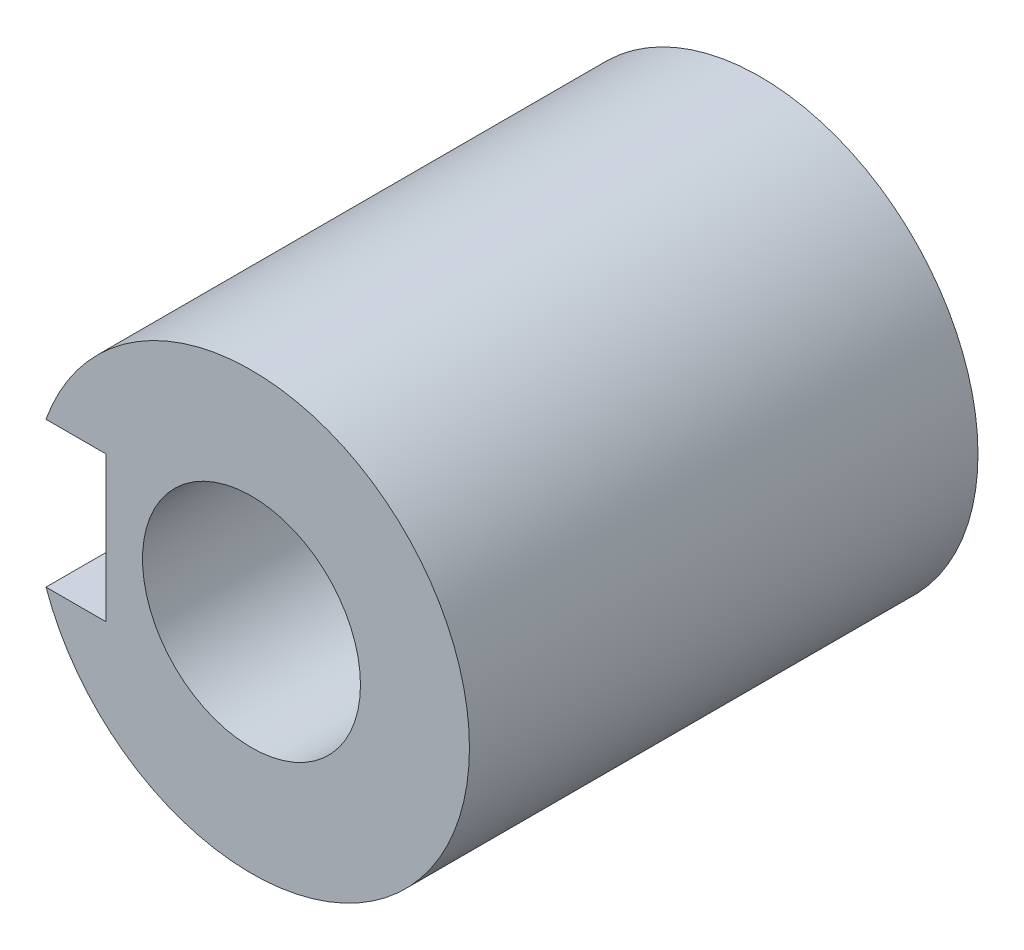
ISO-10303-21;
HEADER;
FILE_DESCRIPTION(('STEP AP214'),'2;1');
FILE_NAME('part.step','',(''),(''),'','','');
FILE_SCHEMA(('AUTOMOTIVE_DESIGN { 1 0 10303 214 1 1 1 1 }'));
ENDSEC;
DATA;
#1=APPLICATION_CONTEXT('core data for automotive mechanical design processes');
#2=APPLICATION_PROTOCOL_DEFINITION('international standard','automotive_design',2000,#1);
#3=PRODUCT_CONTEXT('',#1,'mechanical');
#4=PRODUCT('Part','Part','',(#3));
#5=PRODUCT_RELATED_PRODUCT_CATEGORY('part','',(#4));
#6=PRODUCT_DEFINITION_FORMATION('','',#4);
#7=PRODUCT_DEFINITION_CONTEXT('part definition',#1,'design');
#8=PRODUCT_DEFINITION('design','',#6,#7);
#9=PRODUCT_DEFINITION_SHAPE('','',#8);
#10=(LENGTH_UNIT() NAMED_UNIT(*) SI_UNIT(.MILLI.,.METRE.));
#11=(NAMED_UNIT(*) PLANE_ANGLE_UNIT() SI_UNIT($,.RADIAN.));
#12=(NAMED_UNIT(*) SI_UNIT($,.STERADIAN.) SOLID_ANGLE_UNIT());
#13=UNCERTAINTY_MEASURE_WITH_UNIT(LENGTH_MEASURE(1.E-05),#10,'distance_accuracy_value','');
#14=(GEOMETRIC_REPRESENTATION_CONTEXT(3) GLOBAL_UNCERTAINTY_ASSIGNED_CONTEXT((#13)) GLOBAL_UNIT_ASSIGNED_CONTEXT((#10,
#11,#12)) REPRESENTATION_CONTEXT('',''));
#15=CARTESIAN_POINT('',(0.,0.,0.));
#16=DIRECTION('',(0.,0.,1.));
#17=DIRECTION('',(1.,0.,0.));
#18=AXIS2_PLACEMENT_3D('',#15,#16,#17);
#19=CARTESIAN_POINT('',(3.3166247903554,2.,9.));
#20=DIRECTION('',(0.,0.,-1.));
#21=DIRECTION('',(-1.,0.,0.));
#22=AXIS2_PLACEMENT_3D('',#19,#20,#21);
#23=PLANE('',#22);
#24=CARTESIAN_POINT('',(3.3166247903554,-2.,9.));
#25=DIRECTION('',(0.,0.,-1.));
#26=DIRECTION('',(-1.,0.,0.));
#27=AXIS2_PLACEMENT_3D('',#24,#25,#26);
#28=CIRCLE('',#27,3.);
#29=CARTESIAN_POINT('',(6.,-0.65854650312998,9.));
#30=VERTEX_POINT('',#29);
#31=CARTESIAN_POINT('',(3.3166247903554,-5.,9.));
#32=VERTEX_POINT('',#31);
#33=EDGE_CURVE('E138',#30,#32,#28,.T.);
#34=ORIENTED_EDGE('',*,*,#33,.T.);
#35=CARTESIAN_POINT('',(0.,0.,9.));
#36=DIRECTION('',(0.,0.,-1.));
#37=DIRECTION('',(-1.,0.,0.));
#38=AXIS2_PLACEMENT_3D('',#35,#36,#37);
#39=CIRCLE('',#38,6.);
#40=CARTESIAN_POINT('',(6.,0.,9.));
#41=VERTEX_POINT('',#40);
#42=EDGE_CURVE('E142',#32,#41,#39,.F.);
#43=ORIENTED_EDGE('',*,*,#42,.T.);
#44=DIRECTION('',(0.,-1.,0.));
#45=VECTOR('',#44,1.);
#46=CARTESIAN_POINT('',(6.,0.658546503129978,9.));
#47=LINE('',#46,#45);
#48=EDGE_CURVE('E302',#41,#30,#47,.T.);
#49=ORIENTED_EDGE('',*,*,#48,.T.);
#50=EDGE_LOOP('',(#34,#43,#49));
#51=FACE_BOUND('',#50,.T.);
#52=ADVANCED_FACE('F35',(#51),#23,.T.);
#53=CARTESIAN_POINT('',(6.,0.658546503129978,9.));
#54=VERTEX_POINT('',#53);
#55=EDGE_CURVE('E303',#54,#41,#47,.T.);
#56=ORIENTED_EDGE('',*,*,#55,.T.);
#57=CARTESIAN_POINT('',(3.3166247903554,5.,9.));
#58=VERTEX_POINT('',#57);
#59=EDGE_CURVE('E325',#41,#58,#39,.F.);
#60=ORIENTED_EDGE('',*,*,#59,.T.);
#61=CARTESIAN_POINT('',(3.3166247903554,2.,9.));
#62=DIRECTION('',(0.,0.,-1.));
#63=DIRECTION('',(-1.,0.,0.));
#64=AXIS2_PLACEMENT_3D('',#61,#62,#63);
#65=CIRCLE('',#64,3.);
#66=EDGE_CURVE('E194',#58,#54,#65,.T.);
#67=ORIENTED_EDGE('',*,*,#66,.T.);
#68=EDGE_LOOP('',(#56,#60,#67));
#69=FACE_BOUND('',#68,.T.);
#70=ADVANCED_FACE('F262',(#69),#23,.T.);
#71=DIRECTION('',(0.,1.,0.));
#72=VECTOR('',#71,1.);
#73=CARTESIAN_POINT('',(-6.,0.65854650312998,9.));
#74=LINE('',#73,#72);
#75=CARTESIAN_POINT('',(-6.,-0.658546503129985,9.));
#76=VERTEX_POINT('',#75);
#77=CARTESIAN_POINT('',(-6.,0.,9.));
#78=VERTEX_POINT('',#77);
#79=EDGE_CURVE('E150',#76,#78,#74,.T.);
#80=ORIENTED_EDGE('',*,*,#79,.T.);
#81=CARTESIAN_POINT('',(-3.3166247903554,-5.,9.));
#82=VERTEX_POINT('',#81);
#83=EDGE_CURVE('E50',#78,#82,#39,.F.);
#84=ORIENTED_EDGE('',*,*,#83,.T.);
#85=CARTESIAN_POINT('',(-3.3166247903554,-2.,9.));
#86=DIRECTION('',(0.,0.,-1.));
#87=DIRECTION('',(-1.,0.,0.));
#88=AXIS2_PLACEMENT_3D('',#85,#86,#87);
#89=CIRCLE('',#88,3.);
#90=EDGE_CURVE('E137',#82,#76,#89,.T.);
#91=ORIENTED_EDGE('',*,*,#90,.T.);
#92=EDGE_LOOP('',(#80,#84,#91));
#93=FACE_BOUND('',#92,.T.);
#94=ADVANCED_FACE('F147',(#93),#23,.T.);
#95=CARTESIAN_POINT('',(0.,6.,27.));
#96=DIRECTION('',(0.,0.,1.));
#97=DIRECTION('',(1.,0.,0.));
#98=AXIS2_PLACEMENT_3D('',#95,#96,#97);
#99=PLANE('',#98);
#100=CARTESIAN_POINT('',(0.,0.,27.));
#101=DIRECTION('',(0.,0.,1.));
#102=DIRECTION('',(1.,0.,0.));
#103=AXIS2_PLACEMENT_3D('',#100,#101,#102);
#104=CIRCLE('',#103,6.);
#105=CARTESIAN_POINT('',(6.,0.,27.));
#106=VERTEX_POINT('',#105);
#107=EDGE_CURVE('E295',#106,#106,#104,.T.);
#108=ORIENTED_EDGE('',*,*,#107,.F.);
#109=EDGE_LOOP('',(#108));
#110=FACE_BOUND('',#109,.T.);
#111=CARTESIAN_POINT('',(0.,0.,27.));
#112=DIRECTION('',(0.,0.,1.));
#113=DIRECTION('',(1.,0.,0.));
#114=AXIS2_PLACEMENT_3D('',#111,#112,#113);
#115=CIRCLE('',#114,12.);
#116=CARTESIAN_POINT('',(-11.3137084989848,4.,27.));
#117=VERTEX_POINT('',#116);
#118=CARTESIAN_POINT('',(-11.3137084989848,-4.,27.));
#119=VERTEX_POINT('',#118);
#120=EDGE_CURVE('E43',#117,#119,#115,.F.);
#121=ORIENTED_EDGE('',*,*,#120,.F.);
#122=DIRECTION('',(-1.,0.,0.));
#123=VECTOR('',#122,1.);
#124=CARTESIAN_POINT('',(-11.3137084989848,4.,27.));
#125=LINE('',#124,#123);
#126=CARTESIAN_POINT('',(-8.,4.,27.));
#127=VERTEX_POINT('',#126);
#128=EDGE_CURVE('E225',#127,#117,#125,.T.);
#129=ORIENTED_EDGE('',*,*,#128,.F.);
#130=DIRECTION('',(0.,1.,0.));
#131=VECTOR('',#130,1.);
#132=CARTESIAN_POINT('',(-8.,4.,27.));
#133=LINE('',#132,#131);
#134=CARTESIAN_POINT('',(-8.,-4.,27.));
#135=VERTEX_POINT('',#134);
#136=EDGE_CURVE('E229',#135,#127,#133,.T.);
#137=ORIENTED_EDGE('',*,*,#136,.F.);
#138=DIRECTION('',(1.,0.,0.));
#139=VECTOR('',#138,1.);
#140=CARTESIAN_POINT('',(-11.3137084989848,-4.,27.));
#141=LINE('',#140,#139);
#142=EDGE_CURVE('E210',#119,#135,#141,.T.);
#143=ORIENTED_EDGE('',*,*,#142,.F.);
#144=EDGE_LOOP('',(#121,#129,#137,#143));
#145=FACE_BOUND('',#144,.T.);
#146=ADVANCED_FACE('F37',(#110,#145),#99,.T.);
#147=CARTESIAN_POINT('',(0.,0.,-1.));
#148=DIRECTION('',(0.,0.,-1.));
#149=DIRECTION('',(-1.,0.,0.));
#150=AXIS2_PLACEMENT_3D('',#147,#148,#149);
#151=PLANE('',#150);
#152=CARTESIAN_POINT('',(3.3166247903554,2.,-1.));
#153=DIRECTION('',(0.,0.,-1.));
#154=DIRECTION('',(-1.,0.,0.));
#155=AXIS2_PLACEMENT_3D('',#152,#153,#154);
#156=CIRCLE('',#155,3.);
#157=CARTESIAN_POINT('',(3.3166247903554,5.,-1.));
#158=VERTEX_POINT('',#157);
#159=CARTESIAN_POINT('',(6.,0.658546503129978,-1.));
#160=VERTEX_POINT('',#159);
#161=EDGE_CURVE('E58',#158,#160,#156,.T.);
#162=ORIENTED_EDGE('',*,*,#161,.F.);
#163=DIRECTION('',(1.,0.,0.));
#164=VECTOR('',#163,1.);
#165=CARTESIAN_POINT('',(3.3166247903554,5.,-1.));
#166=LINE('',#165,#164);
#167=CARTESIAN_POINT('',(-3.3166247903554,5.,-1.));
#168=VERTEX_POINT('',#167);
#169=EDGE_CURVE('E191',#168,#158,#166,.T.);
#170=ORIENTED_EDGE('',*,*,#169,.F.);
#171=CARTESIAN_POINT('',(-3.3166247903554,2.,-1.));
#172=DIRECTION('',(0.,0.,-1.));
#173=DIRECTION('',(-1.,0.,0.));
#174=AXIS2_PLACEMENT_3D('',#171,#172,#173);
#175=CIRCLE('',#174,3.);
#176=CARTESIAN_POINT('',(-6.,0.65854650312998,-1.));
#177=VERTEX_POINT('',#176);
#178=EDGE_CURVE('E188',#177,#168,#175,.T.);
#179=ORIENTED_EDGE('',*,*,#178,.F.);
#180=DIRECTION('',(0.,1.,0.));
#181=VECTOR('',#180,1.);
#182=CARTESIAN_POINT('',(-6.,0.65854650312998,-1.));
#183=LINE('',#182,#181);
#184=CARTESIAN_POINT('',(-6.,-0.658546503129985,-1.));
#185=VERTEX_POINT('',#184);
#186=EDGE_CURVE('E185',#185,#177,#183,.T.);
#187=ORIENTED_EDGE('',*,*,#186,.F.);
#188=CARTESIAN_POINT('',(-3.3166247903554,-2.,-1.));
#189=DIRECTION('',(0.,0.,-1.));
#190=DIRECTION('',(-1.,0.,0.));
#191=AXIS2_PLACEMENT_3D('',#188,#189,#190);
#192=CIRCLE('',#191,3.);
#193=CARTESIAN_POINT('',(-3.3166247903554,-5.,-1.));
#194=VERTEX_POINT('',#193);
#195=EDGE_CURVE('E183',#194,#185,#192,.T.);
#196=ORIENTED_EDGE('',*,*,#195,.F.);
#197=DIRECTION('',(-1.,0.,0.));
#198=VECTOR('',#197,1.);
#199=CARTESIAN_POINT('',(3.3166247903554,-5.,-1.));
#200=LINE('',#199,#198);
#201=CARTESIAN_POINT('',(3.3166247903554,-5.,-1.));
#202=VERTEX_POINT('',#201);
#203=EDGE_CURVE('E156',#202,#194,#200,.T.);
#204=ORIENTED_EDGE('',*,*,#203,.F.);
#205=CARTESIAN_POINT('',(3.3166247903554,-2.,-1.));
#206=DIRECTION('',(0.,0.,-1.));
#207=DIRECTION('',(-1.,0.,0.));
#208=AXIS2_PLACEMENT_3D('',#205,#206,#207);
#209=CIRCLE('',#208,3.);
#210=CARTESIAN_POINT('',(6.,-0.65854650312998,-1.));
#211=VERTEX_POINT('',#210);
#212=EDGE_CURVE('E179',#211,#202,#209,.T.);
#213=ORIENTED_EDGE('',*,*,#212,.F.);
#214=DIRECTION('',(0.,-1.,0.));
#215=VECTOR('',#214,1.);
#216=CARTESIAN_POINT('',(6.,0.658546503129978,-1.));
#217=LINE('',#216,#215);
#218=EDGE_CURVE('E176',#160,#211,#217,.T.);
#219=ORIENTED_EDGE('',*,*,#218,.F.);
#220=EDGE_LOOP('',(#162,#170,#179,#187,#196,#204,#213,#219));
#221=FACE_BOUND('',#220,.T.);
#222=CARTESIAN_POINT('',(0.,0.,-1.));
#223=DIRECTION('',(0.,0.,-1.));
#224=DIRECTION('',(-1.,0.,0.));
#225=AXIS2_PLACEMENT_3D('',#222,#223,#224);
#226=CIRCLE('',#225,12.);
#227=CARTESIAN_POINT('',(-11.3137084989848,4.,-1.));
#228=VERTEX_POINT('',#227);
#229=CARTESIAN_POINT('',(-11.3137084989848,-4.,-1.));
#230=VERTEX_POINT('',#229);
#231=EDGE_CURVE('E197',#228,#230,#226,.T.);
#232=ORIENTED_EDGE('',*,*,#231,.T.);
#233=DIRECTION('',(1.,0.,0.));
#234=VECTOR('',#233,1.);
#235=CARTESIAN_POINT('',(-11.3137084989848,-4.,-1.));
#236=LINE('',#235,#234);
#237=CARTESIAN_POINT('',(-8.,-4.,-1.));
#238=VERTEX_POINT('',#237);
#239=EDGE_CURVE('E214',#230,#238,#236,.T.);
#240=ORIENTED_EDGE('',*,*,#239,.T.);
#241=DIRECTION('',(0.,1.,0.));
#242=VECTOR('',#241,1.);
#243=CARTESIAN_POINT('',(-8.,4.,-1.));
#244=LINE('',#243,#242);
#245=CARTESIAN_POINT('',(-8.,4.,-1.));
#246=VERTEX_POINT('',#245);
#247=EDGE_CURVE('E211',#238,#246,#244,.T.);
#248=ORIENTED_EDGE('',*,*,#247,.T.);
#249=DIRECTION('',(-1.,0.,0.));
#250=VECTOR('',#249,1.);
#251=CARTESIAN_POINT('',(-11.3137084989848,4.,-1.));
#252=LINE('',#251,#250);
#253=EDGE_CURVE('E207',#246,#228,#252,.T.);
#254=ORIENTED_EDGE('',*,*,#253,.T.);
#255=EDGE_LOOP('',(#232,#240,#248,#254));
#256=FACE_BOUND('',#255,.T.);
#257=ADVANCED_FACE('F244',(#221,#256),#151,.T.);
#258=CARTESIAN_POINT('',(-11.3137084989848,-4.,60.459363472362));
#259=DIRECTION('',(0.,1.,0.));
#260=DIRECTION('',(-1.,0.,0.));
#261=AXIS2_PLACEMENT_3D('',#258,#259,#260);
#262=PLANE('',#261);
#263=DIRECTION('',(0.,0.,-1.));
#264=VECTOR('',#263,1.);
#265=CARTESIAN_POINT('',(-11.3137084989848,-4.,60.459363472362));
#266=LINE('',#265,#264);
#267=EDGE_CURVE('E11',#119,#230,#266,.T.);
#268=ORIENTED_EDGE('',*,*,#267,.F.);
#269=ORIENTED_EDGE('',*,*,#142,.T.);
#270=DIRECTION('',(0.,0.,-1.));
#271=VECTOR('',#270,1.);
#272=CARTESIAN_POINT('',(-8.,-4.,60.459363472362));
#273=LINE('',#272,#271);
#274=EDGE_CURVE('E221',#135,#238,#273,.T.);
#275=ORIENTED_EDGE('',*,*,#274,.T.);
#276=ORIENTED_EDGE('',*,*,#239,.F.);
#277=EDGE_LOOP('',(#268,#269,#275,#276));
#278=FACE_BOUND('',#277,.T.);
#279=ADVANCED_FACE('F238',(#278),#262,.T.);
#280=CARTESIAN_POINT('',(-8.,4.,60.459363472362));
#281=DIRECTION('',(-1.,0.,0.));
#282=DIRECTION('',(0.,-1.,0.));
#283=AXIS2_PLACEMENT_3D('',#280,#281,#282);
#284=PLANE('',#283);
#285=ORIENTED_EDGE('',*,*,#274,.F.);
#286=ORIENTED_EDGE('',*,*,#136,.T.);
#287=DIRECTION('',(0.,0.,-1.));
#288=VECTOR('',#287,1.);
#289=CARTESIAN_POINT('',(-8.,4.,60.459363472362));
#290=LINE('',#289,#288);
#291=EDGE_CURVE('E228',#127,#246,#290,.T.);
#292=ORIENTED_EDGE('',*,*,#291,.T.);
#293=ORIENTED_EDGE('',*,*,#247,.F.);
#294=EDGE_LOOP('',(#285,#286,#292,#293));
#295=FACE_BOUND('',#294,.T.);
#296=ADVANCED_FACE('F240',(#295),#284,.T.);
#297=CARTESIAN_POINT('',(-11.3137084989848,4.,60.459363472362));
#298=DIRECTION('',(0.,-1.,0.));
#299=DIRECTION('',(0.,0.,-1.));
#300=AXIS2_PLACEMENT_3D('',#297,#298,#299);
#301=PLANE('',#300);
#302=ORIENTED_EDGE('',*,*,#291,.F.);
#303=ORIENTED_EDGE('',*,*,#128,.T.);
#304=DIRECTION('',(0.,0.,-1.));
#305=VECTOR('',#304,1.);
#306=CARTESIAN_POINT('',(-11.3137084989848,4.,60.459363472362));
#307=LINE('',#306,#305);
#308=EDGE_CURVE('E224',#117,#228,#307,.T.);
#309=ORIENTED_EDGE('',*,*,#308,.T.);
#310=ORIENTED_EDGE('',*,*,#253,.F.);
#311=EDGE_LOOP('',(#302,#303,#309,#310));
#312=FACE_BOUND('',#311,.T.);
#313=ADVANCED_FACE('F251',(#312),#301,.T.);
#314=CARTESIAN_POINT('',(0.,0.,60.459363472362));
#315=DIRECTION('',(0.,0.,-1.));
#316=DIRECTION('',(-1.,0.,0.));
#317=AXIS2_PLACEMENT_3D('',#314,#315,#316);
#318=CYLINDRICAL_SURFACE('',#317,12.);
#319=ORIENTED_EDGE('',*,*,#308,.F.);
#320=ORIENTED_EDGE('',*,*,#120,.T.);
#321=ORIENTED_EDGE('',*,*,#267,.T.);
#322=ORIENTED_EDGE('',*,*,#231,.F.);
#323=EDGE_LOOP('',(#319,#320,#321,#322));
#324=FACE_BOUND('',#323,.T.);
#325=ADVANCED_FACE('F248',(#324),#318,.T.);
#326=CARTESIAN_POINT('',(3.3166247903554,2.,9.));
#327=DIRECTION('',(0.,0.,-1.));
#328=DIRECTION('',(-1.,0.,0.));
#329=AXIS2_PLACEMENT_3D('',#326,#327,#328);
#330=CYLINDRICAL_SURFACE('',#329,3.);
#331=ORIENTED_EDGE('',*,*,#161,.T.);
#332=DIRECTION('',(0.,0.,-1.));
#333=VECTOR('',#332,1.);
#334=CARTESIAN_POINT('',(6.,0.658546503129978,9.));
#335=LINE('',#334,#333);
#336=EDGE_CURVE('E174',#54,#160,#335,.T.);
#337=ORIENTED_EDGE('',*,*,#336,.F.);
#338=ORIENTED_EDGE('',*,*,#66,.F.);
#339=DIRECTION('',(0.,0.,-1.));
#340=VECTOR('',#339,1.);
#341=CARTESIAN_POINT('',(3.3166247903554,5.,9.));
#342=LINE('',#341,#340);
#343=EDGE_CURVE('E195',#58,#158,#342,.T.);
#344=ORIENTED_EDGE('',*,*,#343,.T.);
#345=EDGE_LOOP('',(#331,#337,#338,#344));
#346=FACE_BOUND('',#345,.T.);
#347=ADVANCED_FACE('F258',(#346),#330,.F.);
#348=CARTESIAN_POINT('',(3.3166247903554,5.,9.));
#349=DIRECTION('',(0.,1.,0.));
#350=DIRECTION('',(0.,0.,1.));
#351=AXIS2_PLACEMENT_3D('',#348,#349,#350);
#352=PLANE('',#351);
#353=ORIENTED_EDGE('',*,*,#169,.T.);
#354=ORIENTED_EDGE('',*,*,#343,.F.);
#355=DIRECTION('',(1.,0.,0.));
#356=VECTOR('',#355,1.);
#357=CARTESIAN_POINT('',(3.3166247903554,5.,9.));
#358=LINE('',#357,#356);
#359=CARTESIAN_POINT('',(-3.31662479035541,5.,9.));
#360=VERTEX_POINT('',#359);
#361=EDGE_CURVE('E172',#360,#58,#358,.T.);
#362=ORIENTED_EDGE('',*,*,#361,.F.);
#363=DIRECTION('',(0.,0.,-1.));
#364=VECTOR('',#363,1.);
#365=CARTESIAN_POINT('',(-3.3166247903554,5.,9.));
#366=LINE('',#365,#364);
#367=EDGE_CURVE('E198',#360,#168,#366,.T.);
#368=ORIENTED_EDGE('',*,*,#367,.T.);
#369=EDGE_LOOP('',(#353,#354,#362,#368));
#370=FACE_BOUND('',#369,.T.);
#371=ADVANCED_FACE('F329',(#370),#352,.F.);
#372=CARTESIAN_POINT('',(-3.3166247903554,2.,9.));
#373=DIRECTION('',(0.,0.,-1.));
#374=DIRECTION('',(-1.,0.,0.));
#375=AXIS2_PLACEMENT_3D('',#372,#373,#374);
#376=CYLINDRICAL_SURFACE('',#375,3.);
#377=ORIENTED_EDGE('',*,*,#178,.T.);
#378=ORIENTED_EDGE('',*,*,#367,.F.);
#379=CARTESIAN_POINT('',(-3.3166247903554,2.,9.));
#380=DIRECTION('',(0.,0.,-1.));
#381=DIRECTION('',(-1.,0.,0.));
#382=AXIS2_PLACEMENT_3D('',#379,#380,#381);
#383=CIRCLE('',#382,3.);
#384=CARTESIAN_POINT('',(-6.,0.65854650312998,9.));
#385=VERTEX_POINT('',#384);
#386=EDGE_CURVE('E169',#385,#360,#383,.T.);
#387=ORIENTED_EDGE('',*,*,#386,.F.);
#388=DIRECTION('',(0.,0.,-1.));
#389=VECTOR('',#388,1.);
#390=CARTESIAN_POINT('',(-6.,0.65854650312998,9.));
#391=LINE('',#390,#389);
#392=EDGE_CURVE('E200',#385,#177,#391,.T.);
#393=ORIENTED_EDGE('',*,*,#392,.T.);
#394=EDGE_LOOP('',(#377,#378,#387,#393));
#395=FACE_BOUND('',#394,.T.);
#396=ADVANCED_FACE('F327',(#395),#376,.F.);
#397=CARTESIAN_POINT('',(-6.,0.65854650312998,9.));
#398=DIRECTION('',(-1.,0.,0.));
#399=DIRECTION('',(0.,-1.,0.));
#400=AXIS2_PLACEMENT_3D('',#397,#398,#399);
#401=PLANE('',#400);
#402=ORIENTED_EDGE('',*,*,#186,.T.);
#403=ORIENTED_EDGE('',*,*,#392,.F.);
#404=EDGE_CURVE('E164',#78,#385,#74,.T.);
#405=ORIENTED_EDGE('',*,*,#404,.F.);
#406=ORIENTED_EDGE('',*,*,#79,.F.);
#407=DIRECTION('',(0.,0.,-1.));
#408=VECTOR('',#407,1.);
#409=CARTESIAN_POINT('',(-6.,-0.658546503129985,9.));
#410=LINE('',#409,#408);
#411=EDGE_CURVE('E160',#76,#185,#410,.T.);
#412=ORIENTED_EDGE('',*,*,#411,.T.);
#413=EDGE_LOOP('',(#402,#403,#405,#406,#412));
#414=FACE_BOUND('',#413,.T.);
#415=ADVANCED_FACE('F316',(#414),#401,.F.);
#416=CARTESIAN_POINT('',(-3.3166247903554,-2.,9.));
#417=DIRECTION('',(0.,0.,-1.));
#418=DIRECTION('',(-1.,0.,0.));
#419=AXIS2_PLACEMENT_3D('',#416,#417,#418);
#420=CYLINDRICAL_SURFACE('',#419,3.);
#421=ORIENTED_EDGE('',*,*,#195,.T.);
#422=ORIENTED_EDGE('',*,*,#411,.F.);
#423=ORIENTED_EDGE('',*,*,#90,.F.);
#424=DIRECTION('',(0.,0.,-1.));
#425=VECTOR('',#424,1.);
#426=CARTESIAN_POINT('',(-3.3166247903554,-5.,9.));
#427=LINE('',#426,#425);
#428=EDGE_CURVE('E153',#82,#194,#427,.T.);
#429=ORIENTED_EDGE('',*,*,#428,.T.);
#430=EDGE_LOOP('',(#421,#422,#423,#429));
#431=FACE_BOUND('',#430,.T.);
#432=ADVANCED_FACE('F163',(#431),#420,.F.);
#433=CARTESIAN_POINT('',(3.3166247903554,-5.,9.));
#434=DIRECTION('',(0.,-1.,0.));
#435=DIRECTION('',(0.,0.,-1.));
#436=AXIS2_PLACEMENT_3D('',#433,#434,#435);
#437=PLANE('',#436);
#438=ORIENTED_EDGE('',*,*,#203,.T.);
#439=ORIENTED_EDGE('',*,*,#428,.F.);
#440=DIRECTION('',(-1.,0.,0.));
#441=VECTOR('',#440,1.);
#442=CARTESIAN_POINT('',(3.3166247903554,-5.,9.));
#443=LINE('',#442,#441);
#444=EDGE_CURVE('E130',#32,#82,#443,.T.);
#445=ORIENTED_EDGE('',*,*,#444,.F.);
#446=DIRECTION('',(0.,0.,-1.));
#447=VECTOR('',#446,1.);
#448=CARTESIAN_POINT('',(3.3166247903554,-5.,9.));
#449=LINE('',#448,#447);
#450=EDGE_CURVE('E161',#32,#202,#449,.T.);
#451=ORIENTED_EDGE('',*,*,#450,.T.);
#452=EDGE_LOOP('',(#438,#439,#445,#451));
#453=FACE_BOUND('',#452,.T.);
#454=ADVANCED_FACE('F154',(#453),#437,.F.);
#455=CARTESIAN_POINT('',(3.3166247903554,-2.,9.));
#456=DIRECTION('',(0.,0.,-1.));
#457=DIRECTION('',(-1.,0.,0.));
#458=AXIS2_PLACEMENT_3D('',#455,#456,#457);
#459=CYLINDRICAL_SURFACE('',#458,3.);
#460=ORIENTED_EDGE('',*,*,#212,.T.);
#461=ORIENTED_EDGE('',*,*,#450,.F.);
#462=ORIENTED_EDGE('',*,*,#33,.F.);
#463=DIRECTION('',(0.,0.,-1.));
#464=VECTOR('',#463,1.);
#465=CARTESIAN_POINT('',(6.,-0.65854650312998,9.));
#466=LINE('',#465,#464);
#467=EDGE_CURVE('E204',#30,#211,#466,.T.);
#468=ORIENTED_EDGE('',*,*,#467,.T.);
#469=EDGE_LOOP('',(#460,#461,#462,#468));
#470=FACE_BOUND('',#469,.T.);
#471=ADVANCED_FACE('F280',(#470),#459,.F.);
#472=CARTESIAN_POINT('',(6.,0.658546503129978,9.));
#473=DIRECTION('',(1.,0.,0.));
#474=DIRECTION('',(0.,0.,-1.));
#475=AXIS2_PLACEMENT_3D('',#472,#473,#474);
#476=PLANE('',#475);
#477=ORIENTED_EDGE('',*,*,#218,.T.);
#478=ORIENTED_EDGE('',*,*,#467,.F.);
#479=ORIENTED_EDGE('',*,*,#48,.F.);
#480=ORIENTED_EDGE('',*,*,#55,.F.);
#481=ORIENTED_EDGE('',*,*,#336,.T.);
#482=EDGE_LOOP('',(#477,#478,#479,#480,#481));
#483=FACE_BOUND('',#482,.T.);
#484=ADVANCED_FACE('F273',(#483),#476,.F.);
#485=ORIENTED_EDGE('',*,*,#386,.T.);
#486=EDGE_CURVE('E151',#360,#78,#39,.F.);
#487=ORIENTED_EDGE('',*,*,#486,.T.);
#488=ORIENTED_EDGE('',*,*,#404,.T.);
#489=EDGE_LOOP('',(#485,#487,#488));
#490=FACE_BOUND('',#489,.T.);
#491=ADVANCED_FACE('F265',(#490),#23,.T.);
#492=CARTESIAN_POINT('',(3.3166247903554,2.,9.));
#493=DIRECTION('',(0.,0.,-1.));
#494=DIRECTION('',(-1.,0.,0.));
#495=AXIS2_PLACEMENT_3D('',#492,#493,#494);
#496=PLANE('',#495);
#497=ORIENTED_EDGE('',*,*,#444,.T.);
#498=EDGE_CURVE('E132',#82,#32,#39,.F.);
#499=ORIENTED_EDGE('',*,*,#498,.T.);
#500=EDGE_LOOP('',(#497,#499));
#501=FACE_BOUND('',#500,.T.);
#502=ADVANCED_FACE('F131',(#501),#496,.F.);
#503=ORIENTED_EDGE('',*,*,#361,.T.);
#504=EDGE_CURVE('E298',#58,#360,#39,.F.);
#505=ORIENTED_EDGE('',*,*,#504,.T.);
#506=EDGE_LOOP('',(#503,#505));
#507=FACE_BOUND('',#506,.T.);
#508=ADVANCED_FACE('F279',(#507),#496,.F.);
#509=CARTESIAN_POINT('',(0.,0.,-7.97056274847715));
#510=DIRECTION('',(0.,0.,1.));
#511=DIRECTION('',(1.,0.,0.));
#512=AXIS2_PLACEMENT_3D('',#509,#510,#511);
#513=CYLINDRICAL_SURFACE('',#512,6.);
#514=ORIENTED_EDGE('',*,*,#107,.T.);
#515=EDGE_LOOP('',(#514));
#516=FACE_BOUND('',#515,.T.);
#517=ORIENTED_EDGE('',*,*,#83,.F.);
#518=ORIENTED_EDGE('',*,*,#486,.F.);
#519=ORIENTED_EDGE('',*,*,#504,.F.);
#520=ORIENTED_EDGE('',*,*,#59,.F.);
#521=ORIENTED_EDGE('',*,*,#42,.F.);
#522=ORIENTED_EDGE('',*,*,#498,.F.);
#523=EDGE_LOOP('',(#517,#518,#519,#520,#521,#522));
#524=FACE_BOUND('',#523,.T.);
#525=ADVANCED_FACE('F140',(#516,#524),#513,.F.);
#526=CLOSED_SHELL('',(#52,#70,#94,#146,#257,#279,#296,#313,#325,#347,#371,#396,#415,#432,#454,
#471,#484,#491,#502,#508,#525));
#527=MANIFOLD_SOLID_BREP('B2',#526);
#528=ADVANCED_BREP_SHAPE_REPRESENTATION('',(#18,#527),#14);
#529=SHAPE_DEFINITION_REPRESENTATION(#9,#528);
ENDSEC;
END-ISO-10303-21;
